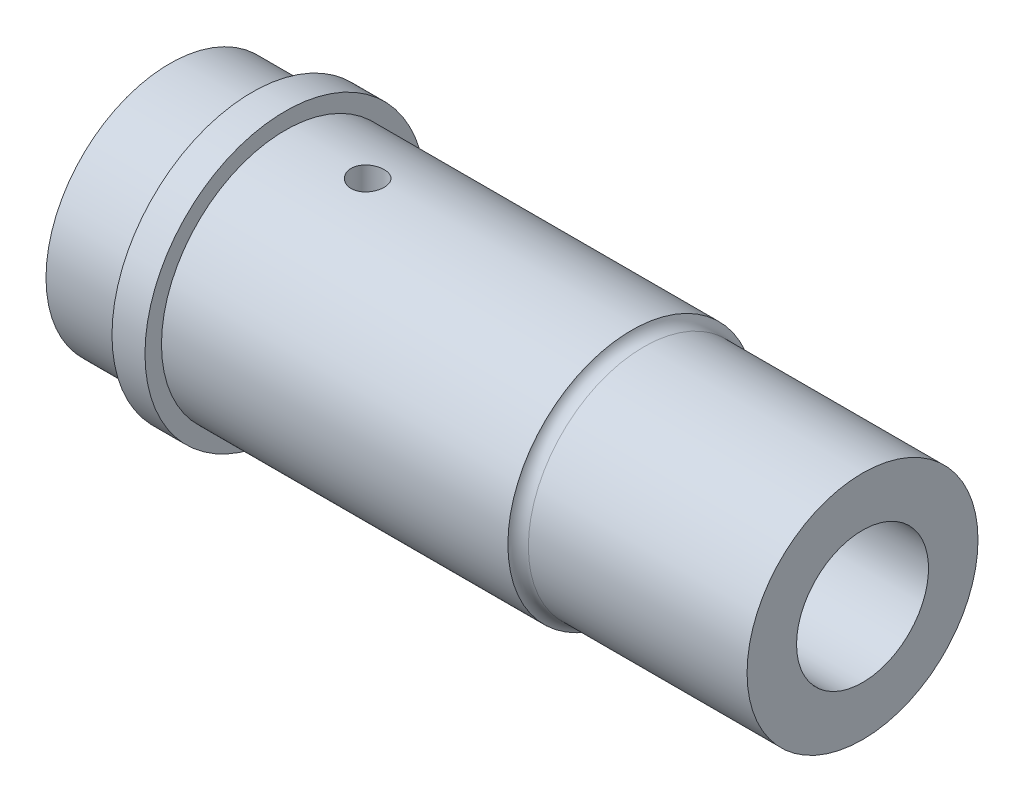
ISO-10303-21;
HEADER;
FILE_DESCRIPTION(('STEP AP214'),'2;1');
FILE_NAME('part.step','',(''),(''),'','','');
FILE_SCHEMA(('AUTOMOTIVE_DESIGN { 1 0 10303 214 1 1 1 1 }'));
ENDSEC;
DATA;
#1=APPLICATION_CONTEXT('core data for automotive mechanical design processes');
#2=APPLICATION_PROTOCOL_DEFINITION('international standard','automotive_design',2000,#1);
#3=PRODUCT_CONTEXT('',#1,'mechanical');
#4=PRODUCT('Part','Part','',(#3));
#5=PRODUCT_RELATED_PRODUCT_CATEGORY('part','',(#4));
#6=PRODUCT_DEFINITION_FORMATION('','',#4);
#7=PRODUCT_DEFINITION_CONTEXT('part definition',#1,'design');
#8=PRODUCT_DEFINITION('design','',#6,#7);
#9=PRODUCT_DEFINITION_SHAPE('','',#8);
#10=(LENGTH_UNIT() NAMED_UNIT(*) SI_UNIT(.MILLI.,.METRE.));
#11=(NAMED_UNIT(*) PLANE_ANGLE_UNIT() SI_UNIT($,.RADIAN.));
#12=(NAMED_UNIT(*) SI_UNIT($,.STERADIAN.) SOLID_ANGLE_UNIT());
#13=UNCERTAINTY_MEASURE_WITH_UNIT(LENGTH_MEASURE(1.E-05),#10,'distance_accuracy_value','');
#14=(GEOMETRIC_REPRESENTATION_CONTEXT(3) GLOBAL_UNCERTAINTY_ASSIGNED_CONTEXT((#13)) GLOBAL_UNIT_ASSIGNED_CONTEXT((#10,
#11,#12)) REPRESENTATION_CONTEXT('',''));
#15=CARTESIAN_POINT('',(0.,0.,0.));
#16=DIRECTION('',(0.,0.,1.));
#17=DIRECTION('',(1.,0.,0.));
#18=AXIS2_PLACEMENT_3D('',#15,#16,#17);
#19=CARTESIAN_POINT('',(42.,0.,0.));
#20=DIRECTION('',(-1.,0.,0.));
#21=DIRECTION('',(0.,0.,1.));
#22=AXIS2_PLACEMENT_3D('',#19,#20,#21);
#23=CYLINDRICAL_SURFACE('',#22,7.5);
#24=CARTESIAN_POINT('',(28.,0.,0.));
#25=DIRECTION('',(1.,0.,0.));
#26=DIRECTION('',(0.,0.,-1.));
#27=AXIS2_PLACEMENT_3D('',#24,#25,#26);
#28=CIRCLE('',#27,7.5);
#29=CARTESIAN_POINT('',(28.,0.,-7.5));
#30=VERTEX_POINT('',#29);
#31=EDGE_CURVE('E156',#30,#30,#28,.T.);
#32=ORIENTED_EDGE('',*,*,#31,.F.);
#33=EDGE_LOOP('',(#32));
#34=FACE_BOUND('',#33,.T.);
#35=CARTESIAN_POINT('',(12.,7.43303437365925,1.));
#36=CARTESIAN_POINT('',(12.0559019277301,7.43303522266631,0.99999764297421));
#37=CARTESIAN_POINT('',(12.1118380165464,7.43367182371829,0.995296633522847));
#38=CARTESIAN_POINT('',(12.222151231157,7.43614824351763,0.976618981332773));
#39=CARTESIAN_POINT('',(12.2765267024564,7.43798929330704,0.962632848245785));
#40=CARTESIAN_POINT('',(12.382105684117,7.44266246058434,0.925806555700512));
#41=CARTESIAN_POINT('',(12.4333114058099,7.4454938777722,0.902972651375005));
#42=CARTESIAN_POINT('',(12.5311555378537,7.45182791129731,0.849112824403647));
#43=CARTESIAN_POINT('',(12.5777946794687,7.45533041990363,0.818088216317403));
#44=CARTESIAN_POINT('',(12.6654867273345,7.46263688659337,0.74851685244753));
#45=CARTESIAN_POINT('',(12.7065064328398,7.4664424424659,0.709928411374281));
#46=CARTESIAN_POINT('',(12.7815081227281,7.47391188129393,0.626414614363067));
#47=CARTESIAN_POINT('',(12.8154897457381,7.47757575696696,0.581488933235995));
#48=CARTESIAN_POINT('',(12.8755709208582,7.48436549880109,0.486365862463802));
#49=CARTESIAN_POINT('',(12.9016402446451,7.48748928251119,0.43614921885561));
#50=CARTESIAN_POINT('',(12.9449630820904,7.49282926707925,0.332001908018684));
#51=CARTESIAN_POINT('',(12.9622169661888,7.49504550607303,0.2780713969612));
#52=CARTESIAN_POINT('',(12.9873194547901,7.49830943097799,0.168367687507043));
#53=CARTESIAN_POINT('',(12.995223407506,7.49936399102537,0.112607361734948));
#54=CARTESIAN_POINT('',(13.0015733043684,7.5002092398576,0.000542501151827599));
#55=CARTESIAN_POINT('',(13.0000196688683,7.49999998481415,-0.0557620093612336));
#56=CARTESIAN_POINT('',(12.9875426347295,7.49834672058453,-0.166940062232885));
#57=CARTESIAN_POINT('',(12.9766787676272,7.49691055668904,-0.221820418680892));
#58=CARTESIAN_POINT('',(12.9459828364892,7.49297362046144,-0.328972061356277));
#59=CARTESIAN_POINT('',(12.9261505824159,7.49047282557017,-0.38124329227092));
#60=CARTESIAN_POINT('',(12.8780182794391,7.48467409502082,-0.481875904212065));
#61=CARTESIAN_POINT('',(12.8496926884085,7.48137376072939,-0.53022492467663));
#62=CARTESIAN_POINT('',(12.7853963713586,7.4743447520952,-0.621505845367393));
#63=CARTESIAN_POINT('',(12.7494252466861,7.47061605542144,-0.664437462933408));
#64=CARTESIAN_POINT('',(12.6705260758205,7.46311294047831,-0.744015030772694));
#65=CARTESIAN_POINT('',(12.6275461159032,7.459338392122,-0.780609516765106));
#66=CARTESIAN_POINT('',(12.5360270343137,7.45219749384619,-0.846073465285956));
#67=CARTESIAN_POINT('',(12.4874878905985,7.44883114554537,-0.874942897181765));
#68=CARTESIAN_POINT('',(12.3861799998266,7.4428878816717,-0.9241414304325));
#69=CARTESIAN_POINT('',(12.3334090477408,7.44031138107393,-0.944466044533533));
#70=CARTESIAN_POINT('',(12.2251609896808,7.43624737732859,-0.97595045022462));
#71=CARTESIAN_POINT('',(12.1696840329867,7.43475981418081,-0.987110746770717));
#72=CARTESIAN_POINT('',(12.0580543324975,7.43305322505173,-0.999880803843635));
#73=CARTESIAN_POINT('',(12.0019100348337,7.43282455755814,-1.00156315549406));
#74=CARTESIAN_POINT('',(11.8901403719476,7.43363612148349,-0.995521440943979));
#75=CARTESIAN_POINT('',(11.8345149941303,7.43467632202375,-0.987797603648882));
#76=CARTESIAN_POINT('',(11.7255820067972,7.43789960218385,-0.963224025185097));
#77=CARTESIAN_POINT('',(11.6722662534909,7.44007823893825,-0.946409751616798));
#78=CARTESIAN_POINT('',(11.5692105432738,7.44532929507204,-0.904169225400625));
#79=CARTESIAN_POINT('',(11.5194707283381,7.44840174991421,-0.878742631046914));
#80=CARTESIAN_POINT('',(11.4246513447796,7.45511723309759,-0.819822032086053));
#81=CARTESIAN_POINT('',(11.3796014758159,7.45876356894567,-0.7862806158315));
#82=CARTESIAN_POINT('',(11.2957445307815,7.46620571758255,-0.712149161563993));
#83=CARTESIAN_POINT('',(11.256937731926,7.47000153699967,-0.671558810718769));
#84=CARTESIAN_POINT('',(11.1864117230394,7.47734474327666,-0.584163774179119));
#85=CARTESIAN_POINT('',(11.1547403418142,7.48089035024858,-0.537320320466262));
#86=CARTESIAN_POINT('',(11.0997158589123,7.48730670739152,-0.43893622615881));
#87=CARTESIAN_POINT('',(11.0763625701219,7.49017747274246,-0.38739569125685));
#88=CARTESIAN_POINT('',(11.0387153692059,7.49491282345577,-0.281236386261717));
#89=CARTESIAN_POINT('',(11.0243942854582,7.49678042410392,-0.226627392123681));
#90=CARTESIAN_POINT('',(11.0051297572695,7.49931158343309,-0.115753246711599));
#91=CARTESIAN_POINT('',(11.0001858286461,7.49997520428063,-0.0594881810999117));
#92=CARTESIAN_POINT('',(10.9998258663798,7.50002323624209,0.0526349368557948));
#93=CARTESIAN_POINT('',(11.0043362647028,7.49941752456714,0.108492762960941));
#94=CARTESIAN_POINT('',(11.022600520616,7.4970146660993,0.218648721526177));
#95=CARTESIAN_POINT('',(11.0363543652607,7.49521752097504,0.272946856170524));
#96=CARTESIAN_POINT('',(11.0726910235383,7.49063278321235,0.37842911729443));
#97=CARTESIAN_POINT('',(11.095269813204,7.48784564204157,0.429614650771956));
#98=CARTESIAN_POINT('',(11.1486077748229,7.48158874697992,0.527482039315438));
#99=CARTESIAN_POINT('',(11.1793670978262,7.47811898048495,0.574163811199582));
#100=CARTESIAN_POINT('',(11.2484633410018,7.47085145604927,0.662073643033369));
#101=CARTESIAN_POINT('',(11.2868548950696,7.46705145149955,0.703258578582));
#102=CARTESIAN_POINT('',(11.3700115345237,7.45956932448384,0.778629477936081));
#103=CARTESIAN_POINT('',(11.4147781219606,7.45588723005032,0.812813787651156));
#104=CARTESIAN_POINT('',(11.5096419707854,7.4490405494253,0.873343954892478));
#105=CARTESIAN_POINT('',(11.559761795755,7.44587830880396,0.89965470214564));
#106=CARTESIAN_POINT('',(11.6637242337586,7.4404568329187,0.943447591407442));
#107=CARTESIAN_POINT('',(11.7175627848798,7.43819663011144,0.960939198331794));
#108=CARTESIAN_POINT('',(11.8097241393627,7.43537566912471,0.982477401892938));
#109=CARTESIAN_POINT('',(11.8474691364837,7.4345021431111,0.989038740679089));
#110=CARTESIAN_POINT('',(11.9234707547356,7.43333120737231,0.997800826715829));
#111=CARTESIAN_POINT('',(11.9617273711999,7.43303379239608,1.00000161371131));
#112=CARTESIAN_POINT('',(12.,7.43303437365925,1.));
#113=B_SPLINE_CURVE_WITH_KNOTS('',3,(#35,#36,#37,#38,#39,#40,#41,#42,#43,#44,#45,#46,#47,#48,
#49,#50,#51,#52,#53,#54,#55,#56,#57,#58,#59,#60,#61,#62,#63,#64,#65,#66,#67,#68,#69,#70,#71,#72,
#73,#74,#75,#76,#77,#78,#79,#80,#81,#82,#83,#84,#85,#86,#87,#88,#89,#90,#91,#92,#93,#94,#95,#96,
#97,#98,#99,#100,#101,#102,#103,#104,#105,#106,#107,#108,#109,#110,#111,#112),.UNSPECIFIED.,.T.,
.F.,(4,2,2,2,2,2,2,2,2,2,2,2,2,2,2,2,2,2,2,2,2,2,2,2,2,2,2,2,2,2,2,2,2,2,2,2,2,2,4),(0.,
0.16756594461955,0.335303423041822,0.502922531373104,0.67051475416376,0.839057975594805,
1.00760984880017,1.17679778261471,1.34597860627362,1.51415284761382,1.68231961431326,
1.84941904333874,2.01652201332237,2.18413264227024,2.35175201291212,2.52067457533377,
2.68959780758443,2.85860963826768,3.02761215573449,3.19531851289863,3.36302078890669,
3.53007342408195,3.69713268808003,3.86519264070064,4.03326005374208,4.2024225588115,
4.37158125836474,4.54022861884065,4.70886727109971,4.87619854927048,5.04352959309218,
5.21078442673995,5.37804234889437,5.54654371183369,5.71508484203598,5.88436670989948,
6.05346651155517,6.16818970471025,6.28291185219902),.UNSPECIFIED.);
#114=CARTESIAN_POINT('',(12.,7.43303437365925,1.));
#115=VERTEX_POINT('',#114);
#116=EDGE_CURVE('E159',#115,#115,#113,.T.);
#117=ORIENTED_EDGE('',*,*,#116,.F.);
#118=EDGE_LOOP('',(#117));
#119=FACE_BOUND('',#118,.T.);
#120=CARTESIAN_POINT('',(7.,0.,0.));
#121=DIRECTION('',(1.,0.,0.));
#122=DIRECTION('',(0.,0.,-1.));
#123=AXIS2_PLACEMENT_3D('',#120,#121,#122);
#124=CIRCLE('',#123,7.5);
#125=CARTESIAN_POINT('',(7.,0.,-7.5));
#126=VERTEX_POINT('',#125);
#127=EDGE_CURVE('E216',#126,#126,#124,.T.);
#128=ORIENTED_EDGE('',*,*,#127,.T.);
#129=EDGE_LOOP('',(#128));
#130=FACE_BOUND('',#129,.T.);
#131=CARTESIAN_POINT('',(27.,0.,0.));
#132=DIRECTION('',(-1.,0.,0.));
#133=DIRECTION('',(0.,0.,1.));
#134=AXIS2_PLACEMENT_3D('',#131,#132,#133);
#135=CIRCLE('',#134,7.5);
#136=CARTESIAN_POINT('',(27.,-7.07106781186548,-2.5));
#137=VERTEX_POINT('',#136);
#138=CARTESIAN_POINT('',(27.,-7.07106781186547,2.5));
#139=VERTEX_POINT('',#138);
#140=EDGE_CURVE('E13',#137,#139,#135,.T.);
#141=ORIENTED_EDGE('',*,*,#140,.F.);
#142=DIRECTION('',(-1.,0.,0.));
#143=VECTOR('',#142,1.);
#144=CARTESIAN_POINT('',(42.,-7.07106781186548,-2.5));
#145=LINE('',#144,#143);
#146=CARTESIAN_POINT('',(8.5,-7.07106781186548,-2.5));
#147=VERTEX_POINT('',#146);
#148=EDGE_CURVE('E48',#137,#147,#145,.T.);
#149=ORIENTED_EDGE('',*,*,#148,.T.);
#150=CARTESIAN_POINT('',(8.5,0.,0.));
#151=DIRECTION('',(1.,0.,0.));
#152=DIRECTION('',(0.,0.,-1.));
#153=AXIS2_PLACEMENT_3D('',#150,#151,#152);
#154=CIRCLE('',#153,7.5);
#155=CARTESIAN_POINT('',(8.5,-7.07106781186547,2.5));
#156=VERTEX_POINT('',#155);
#157=EDGE_CURVE('E237',#156,#147,#154,.T.);
#158=ORIENTED_EDGE('',*,*,#157,.F.);
#159=DIRECTION('',(-1.,0.,0.));
#160=VECTOR('',#159,1.);
#161=CARTESIAN_POINT('',(42.,-7.07106781186547,2.5));
#162=LINE('',#161,#160);
#163=EDGE_CURVE('E239',#156,#139,#162,.F.);
#164=ORIENTED_EDGE('',*,*,#163,.T.);
#165=EDGE_LOOP('',(#141,#149,#158,#164));
#166=FACE_BOUND('',#165,.T.);
#167=ADVANCED_FACE('F40',(#34,#119,#130,#166),#23,.T.);
#168=CARTESIAN_POINT('',(42.,0.,0.));
#169=DIRECTION('',(1.,0.,0.));
#170=DIRECTION('',(0.,0.,-1.));
#171=AXIS2_PLACEMENT_3D('',#168,#169,#170);
#172=PLANE('',#171);
#173=CARTESIAN_POINT('',(42.,0.,0.));
#174=DIRECTION('',(-1.,0.,0.));
#175=DIRECTION('',(0.,0.,1.));
#176=AXIS2_PLACEMENT_3D('',#173,#174,#175);
#177=CIRCLE('',#176,4.);
#178=CARTESIAN_POINT('',(42.,0.,4.));
#179=VERTEX_POINT('',#178);
#180=EDGE_CURVE('E168',#179,#179,#177,.T.);
#181=ORIENTED_EDGE('',*,*,#180,.T.);
#182=EDGE_LOOP('',(#181));
#183=FACE_BOUND('',#182,.T.);
#184=CARTESIAN_POINT('',(42.,0.,0.));
#185=DIRECTION('',(1.,0.,0.));
#186=DIRECTION('',(0.,0.,-1.));
#187=AXIS2_PLACEMENT_3D('',#184,#185,#186);
#188=CIRCLE('',#187,7.);
#189=CARTESIAN_POINT('',(42.,0.,-7.));
#190=VERTEX_POINT('',#189);
#191=EDGE_CURVE('E153',#190,#190,#188,.T.);
#192=ORIENTED_EDGE('',*,*,#191,.T.);
#193=EDGE_LOOP('',(#192));
#194=FACE_BOUND('',#193,.T.);
#195=ADVANCED_FACE('F180',(#183,#194),#172,.T.);
#196=CARTESIAN_POINT('',(5.,0.,0.));
#197=DIRECTION('',(-1.,0.,0.));
#198=DIRECTION('',(0.,0.,1.));
#199=AXIS2_PLACEMENT_3D('',#196,#197,#198);
#200=CYLINDRICAL_SURFACE('',#199,7.5);
#201=CARTESIAN_POINT('',(5.,0.,0.));
#202=DIRECTION('',(1.,0.,0.));
#203=DIRECTION('',(0.,0.,-1.));
#204=AXIS2_PLACEMENT_3D('',#201,#202,#203);
#205=CIRCLE('',#204,7.5);
#206=CARTESIAN_POINT('',(5.,0.,-7.5));
#207=VERTEX_POINT('',#206);
#208=EDGE_CURVE('E209',#207,#207,#205,.T.);
#209=ORIENTED_EDGE('',*,*,#208,.F.);
#210=EDGE_LOOP('',(#209));
#211=FACE_BOUND('',#210,.T.);
#212=CARTESIAN_POINT('',(0.,0.,0.));
#213=DIRECTION('',(1.,0.,0.));
#214=DIRECTION('',(0.,0.,-1.));
#215=AXIS2_PLACEMENT_3D('',#212,#213,#214);
#216=CIRCLE('',#215,7.5);
#217=CARTESIAN_POINT('',(0.,0.,-7.5));
#218=VERTEX_POINT('',#217);
#219=EDGE_CURVE('E212',#218,#218,#216,.T.);
#220=ORIENTED_EDGE('',*,*,#219,.T.);
#221=EDGE_LOOP('',(#220));
#222=FACE_BOUND('',#221,.T.);
#223=ADVANCED_FACE('F183',(#211,#222),#200,.T.);
#224=CARTESIAN_POINT('',(0.,0.,0.));
#225=DIRECTION('',(1.,0.,0.));
#226=DIRECTION('',(0.,0.,-1.));
#227=AXIS2_PLACEMENT_3D('',#224,#225,#226);
#228=PLANE('',#227);
#229=DIRECTION('',(0.,0.,-1.));
#230=VECTOR('',#229,1.);
#231=CARTESIAN_POINT('',(0.,5.5,-1.5));
#232=LINE('',#231,#230);
#233=CARTESIAN_POINT('',(0.,5.5,1.5));
#234=VERTEX_POINT('',#233);
#235=CARTESIAN_POINT('',(0.,5.5,-1.5));
#236=VERTEX_POINT('',#235);
#237=EDGE_CURVE('E144',#234,#236,#232,.T.);
#238=ORIENTED_EDGE('',*,*,#237,.F.);
#239=DIRECTION('',(0.,1.,0.));
#240=VECTOR('',#239,1.);
#241=CARTESIAN_POINT('',(0.,2.5,1.5));
#242=LINE('',#241,#240);
#243=CARTESIAN_POINT('',(0.,3.70809924354783,1.5));
#244=VERTEX_POINT('',#243);
#245=EDGE_CURVE('E134',#244,#234,#242,.T.);
#246=ORIENTED_EDGE('',*,*,#245,.F.);
#247=CARTESIAN_POINT('',(0.,0.,0.));
#248=DIRECTION('',(-1.,0.,0.));
#249=DIRECTION('',(0.,0.,1.));
#250=AXIS2_PLACEMENT_3D('',#247,#248,#249);
#251=CIRCLE('',#250,4.);
#252=CARTESIAN_POINT('',(0.,3.70809924354783,-1.5));
#253=VERTEX_POINT('',#252);
#254=EDGE_CURVE('E167',#253,#244,#251,.T.);
#255=ORIENTED_EDGE('',*,*,#254,.F.);
#256=DIRECTION('',(0.,-1.,0.));
#257=VECTOR('',#256,1.);
#258=CARTESIAN_POINT('',(0.,2.5,-1.5));
#259=LINE('',#258,#257);
#260=EDGE_CURVE('E139',#236,#253,#259,.T.);
#261=ORIENTED_EDGE('',*,*,#260,.F.);
#262=EDGE_LOOP('',(#238,#246,#255,#261));
#263=FACE_BOUND('',#262,.T.);
#264=ORIENTED_EDGE('',*,*,#219,.F.);
#265=EDGE_LOOP('',(#264));
#266=FACE_BOUND('',#265,.T.);
#267=ADVANCED_FACE('F198',(#263,#266),#228,.F.);
#268=CARTESIAN_POINT('',(7.,0.,0.));
#269=DIRECTION('',(-1.,0.,0.));
#270=DIRECTION('',(0.,0.,1.));
#271=AXIS2_PLACEMENT_3D('',#268,#269,#270);
#272=CYLINDRICAL_SURFACE('',#271,8.5);
#273=CARTESIAN_POINT('',(7.,0.,0.));
#274=DIRECTION('',(1.,0.,0.));
#275=DIRECTION('',(0.,0.,-1.));
#276=AXIS2_PLACEMENT_3D('',#273,#274,#275);
#277=CIRCLE('',#276,8.5);
#278=CARTESIAN_POINT('',(7.,0.,-8.5));
#279=VERTEX_POINT('',#278);
#280=EDGE_CURVE('E214',#279,#279,#277,.T.);
#281=ORIENTED_EDGE('',*,*,#280,.F.);
#282=EDGE_LOOP('',(#281));
#283=FACE_BOUND('',#282,.T.);
#284=CARTESIAN_POINT('',(5.,0.,0.));
#285=DIRECTION('',(1.,0.,0.));
#286=DIRECTION('',(0.,0.,-1.));
#287=AXIS2_PLACEMENT_3D('',#284,#285,#286);
#288=CIRCLE('',#287,8.5);
#289=CARTESIAN_POINT('',(5.,0.,-8.5));
#290=VERTEX_POINT('',#289);
#291=EDGE_CURVE('E219',#290,#290,#288,.T.);
#292=ORIENTED_EDGE('',*,*,#291,.T.);
#293=EDGE_LOOP('',(#292));
#294=FACE_BOUND('',#293,.T.);
#295=ADVANCED_FACE('F191',(#283,#294),#272,.T.);
#296=CARTESIAN_POINT('',(7.,0.,0.));
#297=DIRECTION('',(1.,0.,0.));
#298=DIRECTION('',(0.,0.,-1.));
#299=AXIS2_PLACEMENT_3D('',#296,#297,#298);
#300=PLANE('',#299);
#301=ORIENTED_EDGE('',*,*,#127,.F.);
#302=EDGE_LOOP('',(#301));
#303=FACE_BOUND('',#302,.T.);
#304=ORIENTED_EDGE('',*,*,#280,.T.);
#305=EDGE_LOOP('',(#304));
#306=FACE_BOUND('',#305,.T.);
#307=ADVANCED_FACE('F188',(#303,#306),#300,.T.);
#308=CARTESIAN_POINT('',(5.,0.,0.));
#309=DIRECTION('',(1.,0.,0.));
#310=DIRECTION('',(0.,0.,-1.));
#311=AXIS2_PLACEMENT_3D('',#308,#309,#310);
#312=PLANE('',#311);
#313=ORIENTED_EDGE('',*,*,#208,.T.);
#314=EDGE_LOOP('',(#313));
#315=FACE_BOUND('',#314,.T.);
#316=ORIENTED_EDGE('',*,*,#291,.F.);
#317=EDGE_LOOP('',(#316));
#318=FACE_BOUND('',#317,.T.);
#319=ADVANCED_FACE('F178',(#315,#318),#312,.F.);
#320=CARTESIAN_POINT('',(42.,0.,0.));
#321=DIRECTION('',(-1.,0.,0.));
#322=DIRECTION('',(0.,0.,1.));
#323=AXIS2_PLACEMENT_3D('',#320,#321,#322);
#324=CYLINDRICAL_SURFACE('',#323,4.);
#325=ORIENTED_EDGE('',*,*,#254,.T.);
#326=DIRECTION('',(-1.,0.,0.));
#327=VECTOR('',#326,1.);
#328=CARTESIAN_POINT('',(42.,3.70809924354783,1.5));
#329=LINE('',#328,#327);
#330=CARTESIAN_POINT('',(28.,3.70809924354783,1.5));
#331=VERTEX_POINT('',#330);
#332=EDGE_CURVE('E234',#244,#331,#329,.F.);
#333=ORIENTED_EDGE('',*,*,#332,.T.);
#334=CARTESIAN_POINT('',(28.,0.,0.));
#335=DIRECTION('',(1.,0.,0.));
#336=DIRECTION('',(0.,0.,-1.));
#337=AXIS2_PLACEMENT_3D('',#334,#335,#336);
#338=CIRCLE('',#337,4.);
#339=CARTESIAN_POINT('',(28.,3.70809924354783,-1.5));
#340=VERTEX_POINT('',#339);
#341=EDGE_CURVE('E226',#331,#340,#338,.F.);
#342=ORIENTED_EDGE('',*,*,#341,.T.);
#343=DIRECTION('',(-1.,0.,0.));
#344=VECTOR('',#343,1.);
#345=CARTESIAN_POINT('',(42.,3.70809924354783,-1.5));
#346=LINE('',#345,#344);
#347=EDGE_CURVE('E231',#340,#253,#346,.T.);
#348=ORIENTED_EDGE('',*,*,#347,.T.);
#349=EDGE_LOOP('',(#325,#333,#342,#348));
#350=FACE_BOUND('',#349,.T.);
#351=ORIENTED_EDGE('',*,*,#180,.F.);
#352=EDGE_LOOP('',(#351));
#353=FACE_BOUND('',#352,.T.);
#354=ADVANCED_FACE('F175',(#350,#353),#324,.F.);
#355=CARTESIAN_POINT('',(12.,-8.501,0.));
#356=DIRECTION('',(0.,1.,0.));
#357=DIRECTION('',(0.,0.,1.));
#358=AXIS2_PLACEMENT_3D('',#355,#356,#357);
#359=CYLINDRICAL_SURFACE('',#358,1.);
#360=CARTESIAN_POINT('',(12.,5.5,0.));
#361=DIRECTION('',(0.,1.,0.));
#362=DIRECTION('',(0.,0.,1.));
#363=AXIS2_PLACEMENT_3D('',#360,#361,#362);
#364=CIRCLE('',#363,1.);
#365=CARTESIAN_POINT('',(12.,5.5,1.));
#366=VERTEX_POINT('',#365);
#367=EDGE_CURVE('E150',#366,#366,#364,.F.);
#368=ORIENTED_EDGE('',*,*,#367,.T.);
#369=EDGE_LOOP('',(#368));
#370=FACE_BOUND('',#369,.T.);
#371=ORIENTED_EDGE('',*,*,#116,.T.);
#372=EDGE_LOOP('',(#371));
#373=FACE_BOUND('',#372,.T.);
#374=ADVANCED_FACE('F170',(#370,#373),#359,.F.);
#375=CARTESIAN_POINT('',(28.,0.,0.));
#376=DIRECTION('',(1.,0.,0.));
#377=DIRECTION('',(0.,0.,-1.));
#378=AXIS2_PLACEMENT_3D('',#375,#376,#377);
#379=CYLINDRICAL_SURFACE('',#378,7.);
#380=CARTESIAN_POINT('',(28.7416198487096,0.,0.));
#381=DIRECTION('',(-1.,0.,0.));
#382=DIRECTION('',(0.,0.,1.));
#383=AXIS2_PLACEMENT_3D('',#380,#381,#382);
#384=CIRCLE('',#383,7.);
#385=CARTESIAN_POINT('',(28.7416198487096,0.,7.));
#386=VERTEX_POINT('',#385);
#387=EDGE_CURVE('E223',#386,#386,#384,.F.);
#388=ORIENTED_EDGE('',*,*,#387,.T.);
#389=EDGE_LOOP('',(#388));
#390=FACE_BOUND('',#389,.T.);
#391=ORIENTED_EDGE('',*,*,#191,.F.);
#392=EDGE_LOOP('',(#391));
#393=FACE_BOUND('',#392,.T.);
#394=ADVANCED_FACE('F274',(#390,#393),#379,.T.);
#395=CARTESIAN_POINT('',(28.7416198487096,0.,0.));
#396=DIRECTION('',(-1.,0.,0.));
#397=DIRECTION('',(0.,0.,1.));
#398=AXIS2_PLACEMENT_3D('',#395,#396,#397);
#399=TOROIDAL_SURFACE('',#398,7.8,0.8);
#400=ORIENTED_EDGE('',*,*,#31,.T.);
#401=EDGE_LOOP('',(#400));
#402=FACE_BOUND('',#401,.T.);
#403=ORIENTED_EDGE('',*,*,#387,.F.);
#404=EDGE_LOOP('',(#403));
#405=FACE_BOUND('',#404,.T.);
#406=ADVANCED_FACE('F42',(#402,#405),#399,.F.);
#407=CARTESIAN_POINT('',(28.,2.5,1.5));
#408=DIRECTION('',(0.,0.,1.));
#409=DIRECTION('',(1.,0.,0.));
#410=AXIS2_PLACEMENT_3D('',#407,#408,#409);
#411=PLANE('',#410);
#412=ORIENTED_EDGE('',*,*,#245,.T.);
#413=DIRECTION('',(-1.,0.,0.));
#414=VECTOR('',#413,1.);
#415=CARTESIAN_POINT('',(28.,5.5,1.5));
#416=LINE('',#415,#414);
#417=CARTESIAN_POINT('',(28.,5.5,1.5));
#418=VERTEX_POINT('',#417);
#419=EDGE_CURVE('E142',#418,#234,#416,.T.);
#420=ORIENTED_EDGE('',*,*,#419,.F.);
#421=DIRECTION('',(0.,1.,0.));
#422=VECTOR('',#421,1.);
#423=CARTESIAN_POINT('',(28.,2.5,1.5));
#424=LINE('',#423,#422);
#425=EDGE_CURVE('E136',#331,#418,#424,.T.);
#426=ORIENTED_EDGE('',*,*,#425,.F.);
#427=ORIENTED_EDGE('',*,*,#332,.F.);
#428=EDGE_LOOP('',(#412,#420,#426,#427));
#429=FACE_BOUND('',#428,.T.);
#430=ADVANCED_FACE('F267',(#429),#411,.F.);
#431=CARTESIAN_POINT('',(28.,2.5,-1.5));
#432=DIRECTION('',(0.,0.,-1.));
#433=DIRECTION('',(-1.,0.,0.));
#434=AXIS2_PLACEMENT_3D('',#431,#432,#433);
#435=PLANE('',#434);
#436=DIRECTION('',(0.,-1.,0.));
#437=VECTOR('',#436,1.);
#438=CARTESIAN_POINT('',(28.,2.5,-1.5));
#439=LINE('',#438,#437);
#440=CARTESIAN_POINT('',(28.,5.5,-1.5));
#441=VERTEX_POINT('',#440);
#442=EDGE_CURVE('E63',#441,#340,#439,.T.);
#443=ORIENTED_EDGE('',*,*,#442,.F.);
#444=DIRECTION('',(-1.,0.,0.));
#445=VECTOR('',#444,1.);
#446=CARTESIAN_POINT('',(28.,5.5,-1.5));
#447=LINE('',#446,#445);
#448=EDGE_CURVE('E148',#441,#236,#447,.T.);
#449=ORIENTED_EDGE('',*,*,#448,.T.);
#450=ORIENTED_EDGE('',*,*,#260,.T.);
#451=ORIENTED_EDGE('',*,*,#347,.F.);
#452=EDGE_LOOP('',(#443,#449,#450,#451));
#453=FACE_BOUND('',#452,.T.);
#454=ADVANCED_FACE('F264',(#453),#435,.F.);
#455=CARTESIAN_POINT('',(28.,0.,0.));
#456=DIRECTION('',(1.,0.,0.));
#457=DIRECTION('',(0.,0.,-1.));
#458=AXIS2_PLACEMENT_3D('',#455,#456,#457);
#459=PLANE('',#458);
#460=ORIENTED_EDGE('',*,*,#425,.T.);
#461=DIRECTION('',(0.,0.,-1.));
#462=VECTOR('',#461,1.);
#463=CARTESIAN_POINT('',(28.,5.5,-1.5));
#464=LINE('',#463,#462);
#465=EDGE_CURVE('E138',#418,#441,#464,.T.);
#466=ORIENTED_EDGE('',*,*,#465,.T.);
#467=ORIENTED_EDGE('',*,*,#442,.T.);
#468=ORIENTED_EDGE('',*,*,#341,.F.);
#469=EDGE_LOOP('',(#460,#466,#467,#468));
#470=FACE_BOUND('',#469,.T.);
#471=ADVANCED_FACE('F261',(#470),#459,.F.);
#472=CARTESIAN_POINT('',(28.,5.5,-1.5));
#473=DIRECTION('',(0.,1.,0.));
#474=DIRECTION('',(0.,0.,1.));
#475=AXIS2_PLACEMENT_3D('',#472,#473,#474);
#476=PLANE('',#475);
#477=ORIENTED_EDGE('',*,*,#237,.T.);
#478=ORIENTED_EDGE('',*,*,#448,.F.);
#479=ORIENTED_EDGE('',*,*,#465,.F.);
#480=ORIENTED_EDGE('',*,*,#419,.T.);
#481=EDGE_LOOP('',(#477,#478,#479,#480));
#482=FACE_BOUND('',#481,.T.);
#483=ORIENTED_EDGE('',*,*,#367,.F.);
#484=EDGE_LOOP('',(#483));
#485=FACE_BOUND('',#484,.T.);
#486=ADVANCED_FACE('F260',(#482,#485),#476,.F.);
#487=CARTESIAN_POINT('',(-0.0710678118654787,-10.,-2.5));
#488=DIRECTION('',(0.,0.,-1.));
#489=DIRECTION('',(-1.,0.,0.));
#490=AXIS2_PLACEMENT_3D('',#487,#488,#489);
#491=PLANE('',#490);
#492=DIRECTION('',(0.,1.,0.));
#493=VECTOR('',#492,1.);
#494=CARTESIAN_POINT('',(27.,-10.,-2.5));
#495=LINE('',#494,#493);
#496=CARTESIAN_POINT('',(27.,-5.,-2.5));
#497=VERTEX_POINT('',#496);
#498=EDGE_CURVE('E105',#137,#497,#495,.T.);
#499=ORIENTED_EDGE('',*,*,#498,.T.);
#500=DIRECTION('',(1.,0.,0.));
#501=VECTOR('',#500,1.);
#502=CARTESIAN_POINT('',(-0.0710678118654787,-5.,-2.5));
#503=LINE('',#502,#501);
#504=CARTESIAN_POINT('',(8.5,-5.,-2.5));
#505=VERTEX_POINT('',#504);
#506=EDGE_CURVE('E109',#505,#497,#503,.T.);
#507=ORIENTED_EDGE('',*,*,#506,.F.);
#508=DIRECTION('',(0.,-1.,0.));
#509=VECTOR('',#508,1.);
#510=CARTESIAN_POINT('',(8.5,-10.,-2.5));
#511=LINE('',#510,#509);
#512=EDGE_CURVE('E135',#505,#147,#511,.T.);
#513=ORIENTED_EDGE('',*,*,#512,.T.);
#514=ORIENTED_EDGE('',*,*,#148,.F.);
#515=EDGE_LOOP('',(#499,#507,#513,#514));
#516=FACE_BOUND('',#515,.T.);
#517=ADVANCED_FACE('F107',(#516),#491,.F.);
#518=CARTESIAN_POINT('',(-0.0710678118654787,-10.,2.5));
#519=DIRECTION('',(0.,0.,1.));
#520=DIRECTION('',(1.,0.,0.));
#521=AXIS2_PLACEMENT_3D('',#518,#519,#520);
#522=PLANE('',#521);
#523=DIRECTION('',(0.,1.,0.));
#524=VECTOR('',#523,1.);
#525=CARTESIAN_POINT('',(8.5,-10.,2.5));
#526=LINE('',#525,#524);
#527=CARTESIAN_POINT('',(8.5,-5.,2.5));
#528=VERTEX_POINT('',#527);
#529=EDGE_CURVE('E55',#156,#528,#526,.T.);
#530=ORIENTED_EDGE('',*,*,#529,.T.);
#531=DIRECTION('',(1.,0.,0.));
#532=VECTOR('',#531,1.);
#533=CARTESIAN_POINT('',(-0.0710678118654787,-5.,2.5));
#534=LINE('',#533,#532);
#535=CARTESIAN_POINT('',(27.,-5.,2.5));
#536=VERTEX_POINT('',#535);
#537=EDGE_CURVE('E122',#528,#536,#534,.T.);
#538=ORIENTED_EDGE('',*,*,#537,.T.);
#539=DIRECTION('',(0.,-1.,0.));
#540=VECTOR('',#539,1.);
#541=CARTESIAN_POINT('',(27.,-10.,2.5));
#542=LINE('',#541,#540);
#543=EDGE_CURVE('E123',#536,#139,#542,.T.);
#544=ORIENTED_EDGE('',*,*,#543,.T.);
#545=ORIENTED_EDGE('',*,*,#163,.F.);
#546=EDGE_LOOP('',(#530,#538,#544,#545));
#547=FACE_BOUND('',#546,.T.);
#548=ADVANCED_FACE('F244',(#547),#522,.F.);
#549=CARTESIAN_POINT('',(27.,0.,0.));
#550=DIRECTION('',(-1.,0.,0.));
#551=DIRECTION('',(0.,0.,1.));
#552=AXIS2_PLACEMENT_3D('',#549,#550,#551);
#553=PLANE('',#552);
#554=ORIENTED_EDGE('',*,*,#140,.T.);
#555=ORIENTED_EDGE('',*,*,#543,.F.);
#556=DIRECTION('',(0.,0.,1.));
#557=VECTOR('',#556,1.);
#558=CARTESIAN_POINT('',(27.,-5.,2.5));
#559=LINE('',#558,#557);
#560=EDGE_CURVE('E114',#497,#536,#559,.T.);
#561=ORIENTED_EDGE('',*,*,#560,.F.);
#562=ORIENTED_EDGE('',*,*,#498,.F.);
#563=EDGE_LOOP('',(#554,#555,#561,#562));
#564=FACE_BOUND('',#563,.T.);
#565=ADVANCED_FACE('F126',(#564),#553,.T.);
#566=CARTESIAN_POINT('',(8.5,0.,0.));
#567=DIRECTION('',(1.,0.,0.));
#568=DIRECTION('',(0.,0.,-1.));
#569=AXIS2_PLACEMENT_3D('',#566,#567,#568);
#570=PLANE('',#569);
#571=ORIENTED_EDGE('',*,*,#157,.T.);
#572=ORIENTED_EDGE('',*,*,#512,.F.);
#573=DIRECTION('',(0.,0.,-1.));
#574=VECTOR('',#573,1.);
#575=CARTESIAN_POINT('',(8.5,-5.,2.5));
#576=LINE('',#575,#574);
#577=EDGE_CURVE('E120',#528,#505,#576,.T.);
#578=ORIENTED_EDGE('',*,*,#577,.F.);
#579=ORIENTED_EDGE('',*,*,#529,.F.);
#580=EDGE_LOOP('',(#571,#572,#578,#579));
#581=FACE_BOUND('',#580,.T.);
#582=ADVANCED_FACE('F245',(#581),#570,.T.);
#583=CARTESIAN_POINT('',(-0.0710678118654787,-5.,2.5));
#584=DIRECTION('',(0.,1.,0.));
#585=DIRECTION('',(0.,0.,1.));
#586=AXIS2_PLACEMENT_3D('',#583,#584,#585);
#587=PLANE('',#586);
#588=ORIENTED_EDGE('',*,*,#577,.T.);
#589=ORIENTED_EDGE('',*,*,#506,.T.);
#590=ORIENTED_EDGE('',*,*,#560,.T.);
#591=ORIENTED_EDGE('',*,*,#537,.F.);
#592=EDGE_LOOP('',(#588,#589,#590,#591));
#593=FACE_BOUND('',#592,.T.);
#594=ADVANCED_FACE('F118',(#593),#587,.F.);
#595=CLOSED_SHELL('',(#167,#195,#223,#267,#295,#307,#319,#354,#374,#394,#406,#430,#454,#471,
#486,#517,#548,#565,#582,#594));
#596=MANIFOLD_SOLID_BREP('B2',#595);
#597=ADVANCED_BREP_SHAPE_REPRESENTATION('',(#18,#596),#14);
#598=SHAPE_DEFINITION_REPRESENTATION(#9,#597);
ENDSEC;
END-ISO-10303-21;
